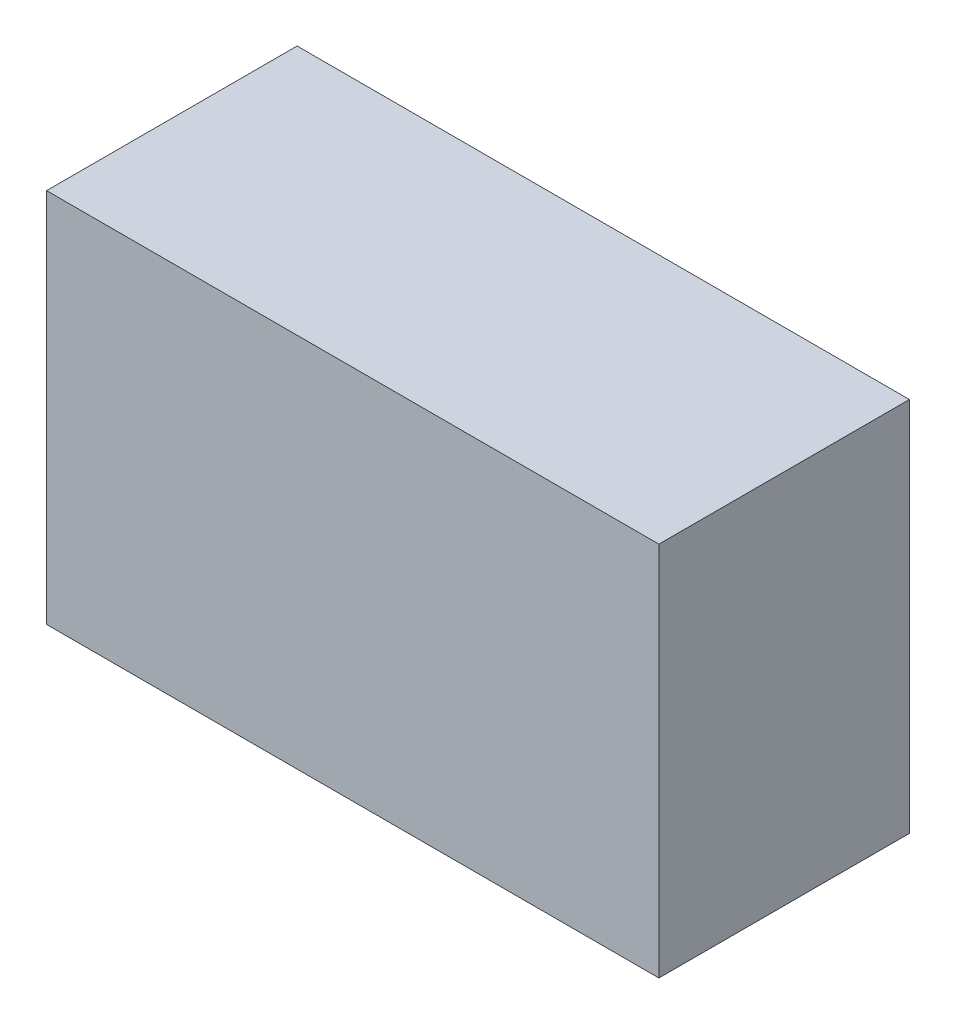
ISO-10303-21;
HEADER;
FILE_DESCRIPTION(('STEP AP214'),'2;1');
FILE_NAME('part.step','',(''),(''),'','','');
FILE_SCHEMA(('AUTOMOTIVE_DESIGN { 1 0 10303 214 1 1 1 1 }'));
ENDSEC;
DATA;
#1=APPLICATION_CONTEXT('core data for automotive mechanical design processes');
#2=APPLICATION_PROTOCOL_DEFINITION('international standard','automotive_design',2000,#1);
#3=PRODUCT_CONTEXT('',#1,'mechanical');
#4=PRODUCT('Part','Part','',(#3));
#5=PRODUCT_RELATED_PRODUCT_CATEGORY('part','',(#4));
#6=PRODUCT_DEFINITION_FORMATION('','',#4);
#7=PRODUCT_DEFINITION_CONTEXT('part definition',#1,'design');
#8=PRODUCT_DEFINITION('design','',#6,#7);
#9=PRODUCT_DEFINITION_SHAPE('','',#8);
#10=(LENGTH_UNIT() NAMED_UNIT(*) SI_UNIT(.MILLI.,.METRE.));
#11=(NAMED_UNIT(*) PLANE_ANGLE_UNIT() SI_UNIT($,.RADIAN.));
#12=(NAMED_UNIT(*) SI_UNIT($,.STERADIAN.) SOLID_ANGLE_UNIT());
#13=UNCERTAINTY_MEASURE_WITH_UNIT(LENGTH_MEASURE(1.E-05),#10,'distance_accuracy_value','');
#14=(GEOMETRIC_REPRESENTATION_CONTEXT(3) GLOBAL_UNCERTAINTY_ASSIGNED_CONTEXT((#13)) GLOBAL_UNIT_ASSIGNED_CONTEXT((#10,
#11,#12)) REPRESENTATION_CONTEXT('',''));
#15=CARTESIAN_POINT('',(0.,0.,0.));
#16=DIRECTION('',(0.,0.,1.));
#17=DIRECTION('',(1.,0.,0.));
#18=AXIS2_PLACEMENT_3D('',#15,#16,#17);
#19=CARTESIAN_POINT('',(1.10000034,0.67499992,0.90000074));
#20=DIRECTION('',(0.,0.,-1.));
#21=DIRECTION('',(-1.,0.,0.));
#22=AXIS2_PLACEMENT_3D('',#19,#20,#21);
#23=PLANE('',#22);
#24=DIRECTION('',(0.,1.,0.));
#25=VECTOR('',#24,1.);
#26=CARTESIAN_POINT('',(-1.0999978,0.67499992,0.90000074));
#27=LINE('',#26,#25);
#28=CARTESIAN_POINT('',(-1.0999978,0.67499992,0.90000074));
#29=VERTEX_POINT('',#28);
#30=CARTESIAN_POINT('',(-1.0999978,-0.67499992,0.90000074));
#31=VERTEX_POINT('',#30);
#32=EDGE_CURVE('E55',#29,#31,#27,.F.);
#33=ORIENTED_EDGE('',*,*,#32,.T.);
#34=DIRECTION('',(1.,0.,0.));
#35=VECTOR('',#34,1.);
#36=CARTESIAN_POINT('',(-1.0999978,-0.67499992,0.90000074));
#37=LINE('',#36,#35);
#38=CARTESIAN_POINT('',(1.10000034,-0.67499992,0.90000074));
#39=VERTEX_POINT('',#38);
#40=EDGE_CURVE('E57',#31,#39,#37,.T.);
#41=ORIENTED_EDGE('',*,*,#40,.T.);
#42=DIRECTION('',(0.,1.,0.));
#43=VECTOR('',#42,1.);
#44=CARTESIAN_POINT('',(1.10000034,-0.67499992,0.90000074));
#45=LINE('',#44,#43);
#46=CARTESIAN_POINT('',(1.10000034,0.67499992,0.90000074));
#47=VERTEX_POINT('',#46);
#48=EDGE_CURVE('E20',#39,#47,#45,.T.);
#49=ORIENTED_EDGE('',*,*,#48,.T.);
#50=DIRECTION('',(1.,0.,0.));
#51=VECTOR('',#50,1.);
#52=CARTESIAN_POINT('',(1.10000034,0.67499992,0.90000074));
#53=LINE('',#52,#51);
#54=EDGE_CURVE('E80',#47,#29,#53,.F.);
#55=ORIENTED_EDGE('',*,*,#54,.T.);
#56=EDGE_LOOP('',(#33,#41,#49,#55));
#57=FACE_BOUND('',#56,.T.);
#58=ADVANCED_FACE('F17',(#57),#23,.F.);
#59=CARTESIAN_POINT('',(1.10000034,-0.67499992,0.));
#60=DIRECTION('',(-1.,0.,0.));
#61=DIRECTION('',(0.,0.,1.));
#62=AXIS2_PLACEMENT_3D('',#59,#60,#61);
#63=PLANE('',#62);
#64=DIRECTION('',(0.,0.,-1.));
#65=VECTOR('',#64,1.);
#66=CARTESIAN_POINT('',(1.10000034,0.67499992,0.));
#67=LINE('',#66,#65);
#68=CARTESIAN_POINT('',(1.10000034,0.67499992,0.));
#69=VERTEX_POINT('',#68);
#70=EDGE_CURVE('E68',#69,#47,#67,.F.);
#71=ORIENTED_EDGE('',*,*,#70,.T.);
#72=ORIENTED_EDGE('',*,*,#48,.F.);
#73=DIRECTION('',(0.,0.,1.));
#74=VECTOR('',#73,1.);
#75=CARTESIAN_POINT('',(1.10000034,-0.67499992,0.));
#76=LINE('',#75,#74);
#77=CARTESIAN_POINT('',(1.10000034,-0.67499992,0.));
#78=VERTEX_POINT('',#77);
#79=EDGE_CURVE('E63',#39,#78,#76,.F.);
#80=ORIENTED_EDGE('',*,*,#79,.T.);
#81=DIRECTION('',(0.,1.,0.));
#82=VECTOR('',#81,1.);
#83=CARTESIAN_POINT('',(1.10000034,0.67499992,0.));
#84=LINE('',#83,#82);
#85=EDGE_CURVE('E83',#69,#78,#84,.F.);
#86=ORIENTED_EDGE('',*,*,#85,.F.);
#87=EDGE_LOOP('',(#71,#72,#80,#86));
#88=FACE_BOUND('',#87,.T.);
#89=ADVANCED_FACE('F65',(#88),#63,.F.);
#90=CARTESIAN_POINT('',(-1.0999978,-0.67499992,0.));
#91=DIRECTION('',(0.,1.,0.));
#92=DIRECTION('',(0.,0.,1.));
#93=AXIS2_PLACEMENT_3D('',#90,#91,#92);
#94=PLANE('',#93);
#95=ORIENTED_EDGE('',*,*,#79,.F.);
#96=ORIENTED_EDGE('',*,*,#40,.F.);
#97=DIRECTION('',(0.,0.,-1.));
#98=VECTOR('',#97,1.);
#99=CARTESIAN_POINT('',(-1.0999978,-0.67499992,0.));
#100=LINE('',#99,#98);
#101=CARTESIAN_POINT('',(-1.0999978,-0.67499992,0.));
#102=VERTEX_POINT('',#101);
#103=EDGE_CURVE('E75',#31,#102,#100,.T.);
#104=ORIENTED_EDGE('',*,*,#103,.T.);
#105=DIRECTION('',(-1.,0.,0.));
#106=VECTOR('',#105,1.);
#107=CARTESIAN_POINT('',(1.10000034,-0.67499992,0.));
#108=LINE('',#107,#106);
#109=EDGE_CURVE('E72',#78,#102,#108,.T.);
#110=ORIENTED_EDGE('',*,*,#109,.F.);
#111=EDGE_LOOP('',(#95,#96,#104,#110));
#112=FACE_BOUND('',#111,.T.);
#113=ADVANCED_FACE('F70',(#112),#94,.F.);
#114=CARTESIAN_POINT('',(-1.0999978,0.67499992,0.));
#115=DIRECTION('',(1.,0.,0.));
#116=DIRECTION('',(0.,0.,-1.));
#117=AXIS2_PLACEMENT_3D('',#114,#115,#116);
#118=PLANE('',#117);
#119=ORIENTED_EDGE('',*,*,#103,.F.);
#120=ORIENTED_EDGE('',*,*,#32,.F.);
#121=DIRECTION('',(0.,0.,-1.));
#122=VECTOR('',#121,1.);
#123=CARTESIAN_POINT('',(-1.0999978,0.67499992,0.));
#124=LINE('',#123,#122);
#125=CARTESIAN_POINT('',(-1.0999978,0.67499992,0.));
#126=VERTEX_POINT('',#125);
#127=EDGE_CURVE('E35',#29,#126,#124,.T.);
#128=ORIENTED_EDGE('',*,*,#127,.T.);
#129=DIRECTION('',(0.,1.,0.));
#130=VECTOR('',#129,1.);
#131=CARTESIAN_POINT('',(-1.0999978,0.67499992,0.));
#132=LINE('',#131,#130);
#133=EDGE_CURVE('E26',#102,#126,#132,.T.);
#134=ORIENTED_EDGE('',*,*,#133,.F.);
#135=EDGE_LOOP('',(#119,#120,#128,#134));
#136=FACE_BOUND('',#135,.T.);
#137=ADVANCED_FACE('F89',(#136),#118,.F.);
#138=CARTESIAN_POINT('',(1.10000034,0.67499992,0.));
#139=DIRECTION('',(0.,-1.,0.));
#140=DIRECTION('',(0.,0.,-1.));
#141=AXIS2_PLACEMENT_3D('',#138,#139,#140);
#142=PLANE('',#141);
#143=ORIENTED_EDGE('',*,*,#127,.F.);
#144=ORIENTED_EDGE('',*,*,#54,.F.);
#145=ORIENTED_EDGE('',*,*,#70,.F.);
#146=DIRECTION('',(-1.,0.,0.));
#147=VECTOR('',#146,1.);
#148=CARTESIAN_POINT('',(1.10000034,0.67499992,0.));
#149=LINE('',#148,#147);
#150=EDGE_CURVE('E11',#126,#69,#149,.F.);
#151=ORIENTED_EDGE('',*,*,#150,.F.);
#152=EDGE_LOOP('',(#143,#144,#145,#151));
#153=FACE_BOUND('',#152,.T.);
#154=ADVANCED_FACE('F91',(#153),#142,.F.);
#155=CARTESIAN_POINT('',(1.10000034,0.67499992,0.));
#156=DIRECTION('',(0.,0.,-1.));
#157=DIRECTION('',(-1.,0.,0.));
#158=AXIS2_PLACEMENT_3D('',#155,#156,#157);
#159=PLANE('',#158);
#160=ORIENTED_EDGE('',*,*,#133,.T.);
#161=ORIENTED_EDGE('',*,*,#150,.T.);
#162=ORIENTED_EDGE('',*,*,#85,.T.);
#163=ORIENTED_EDGE('',*,*,#109,.T.);
#164=EDGE_LOOP('',(#160,#161,#162,#163));
#165=FACE_BOUND('',#164,.T.);
#166=ADVANCED_FACE('F88',(#165),#159,.T.);
#167=CLOSED_SHELL('',(#58,#89,#113,#137,#154,#166));
#168=MANIFOLD_SOLID_BREP('B1',#167);
#169=ADVANCED_BREP_SHAPE_REPRESENTATION('',(#18,#168),#14);
#170=SHAPE_DEFINITION_REPRESENTATION(#9,#169);
ENDSEC;
END-ISO-10303-21;
